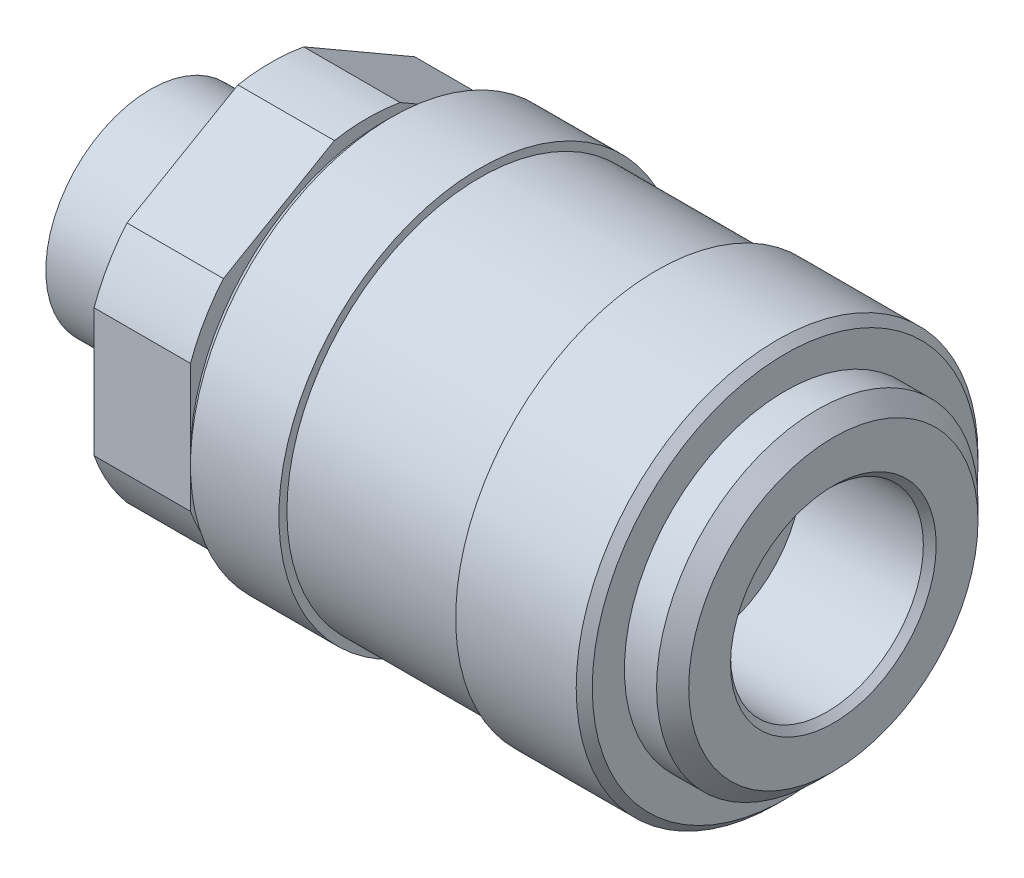
ISO-10303-21;
HEADER;
FILE_DESCRIPTION(('STEP AP214'),'2;1');
FILE_NAME('part.step','',(''),(''),'','','');
FILE_SCHEMA(('AUTOMOTIVE_DESIGN { 1 0 10303 214 1 1 1 1 }'));
ENDSEC;
DATA;
#1=APPLICATION_CONTEXT('core data for automotive mechanical design processes');
#2=APPLICATION_PROTOCOL_DEFINITION('international standard','automotive_design',2000,#1);
#3=PRODUCT_CONTEXT('',#1,'mechanical');
#4=PRODUCT('Part','Part','',(#3));
#5=PRODUCT_RELATED_PRODUCT_CATEGORY('part','',(#4));
#6=PRODUCT_DEFINITION_FORMATION('','',#4);
#7=PRODUCT_DEFINITION_CONTEXT('part definition',#1,'design');
#8=PRODUCT_DEFINITION('design','',#6,#7);
#9=PRODUCT_DEFINITION_SHAPE('','',#8);
#10=(LENGTH_UNIT() NAMED_UNIT(*) SI_UNIT(.MILLI.,.METRE.));
#11=(NAMED_UNIT(*) PLANE_ANGLE_UNIT() SI_UNIT($,.RADIAN.));
#12=(NAMED_UNIT(*) SI_UNIT($,.STERADIAN.) SOLID_ANGLE_UNIT());
#13=UNCERTAINTY_MEASURE_WITH_UNIT(LENGTH_MEASURE(1.E-05),#10,'distance_accuracy_value','');
#14=(GEOMETRIC_REPRESENTATION_CONTEXT(3) GLOBAL_UNCERTAINTY_ASSIGNED_CONTEXT((#13)) GLOBAL_UNIT_ASSIGNED_CONTEXT((#10,
#11,#12)) REPRESENTATION_CONTEXT('',''));
#15=CARTESIAN_POINT('',(0.,0.,0.));
#16=DIRECTION('',(0.,0.,1.));
#17=DIRECTION('',(1.,0.,0.));
#18=AXIS2_PLACEMENT_3D('',#15,#16,#17);
#19=CARTESIAN_POINT('',(18.0000000003133,0.,0.));
#20=DIRECTION('',(1.,0.,0.));
#21=DIRECTION('',(0.,0.,-1.));
#22=AXIS2_PLACEMENT_3D('',#19,#20,#21);
#23=CONICAL_SURFACE('',#22,3.49999999946249,0.785398162516375);
#24=CARTESIAN_POINT('',(17.,0.,0.));
#25=DIRECTION('',(1.,0.,0.));
#26=DIRECTION('',(0.,0.,-1.));
#27=AXIS2_PLACEMENT_3D('',#24,#25,#26);
#28=CIRCLE('',#27,2.5);
#29=CARTESIAN_POINT('',(17.,0.,-2.5));
#30=VERTEX_POINT('',#29);
#31=EDGE_CURVE('E165',#30,#30,#28,.F.);
#32=ORIENTED_EDGE('',*,*,#31,.T.);
#33=EDGE_LOOP('',(#32));
#34=FACE_BOUND('',#33,.T.);
#35=CARTESIAN_POINT('',(18.0000000003702,0.,0.));
#36=DIRECTION('',(1.,0.,0.));
#37=DIRECTION('',(0.,0.,-1.));
#38=AXIS2_PLACEMENT_3D('',#35,#36,#37);
#39=CIRCLE('',#38,3.49999999951933);
#40=CARTESIAN_POINT('',(18.0000000003702,0.,-3.49999999951933));
#41=VERTEX_POINT('',#40);
#42=EDGE_CURVE('E19',#41,#41,#39,.F.);
#43=ORIENTED_EDGE('',*,*,#42,.F.);
#44=EDGE_LOOP('',(#43));
#45=FACE_BOUND('',#44,.T.);
#46=ADVANCED_FACE('F16',(#34,#45),#23,.F.);
#47=CARTESIAN_POINT('',(18.,0.,0.));
#48=DIRECTION('',(1.,0.,0.));
#49=DIRECTION('',(0.,0.,-1.));
#50=AXIS2_PLACEMENT_3D('',#47,#48,#49);
#51=PLANE('',#50);
#52=ORIENTED_EDGE('',*,*,#42,.T.);
#53=EDGE_LOOP('',(#52));
#54=FACE_BOUND('',#53,.T.);
#55=CARTESIAN_POINT('',(18.,0.,0.));
#56=DIRECTION('',(1.,0.,0.));
#57=DIRECTION('',(0.,0.,-1.));
#58=AXIS2_PLACEMENT_3D('',#55,#56,#57);
#59=CIRCLE('',#58,3.65);
#60=CARTESIAN_POINT('',(18.,0.,-3.65000000000001));
#61=VERTEX_POINT('',#60);
#62=EDGE_CURVE('E168',#61,#61,#59,.T.);
#63=ORIENTED_EDGE('',*,*,#62,.T.);
#64=EDGE_LOOP('',(#63));
#65=FACE_BOUND('',#64,.T.);
#66=ADVANCED_FACE('F254',(#54,#65),#51,.T.);
#67=CARTESIAN_POINT('',(1.,0.,0.));
#68=DIRECTION('',(1.,0.,0.));
#69=DIRECTION('',(0.,0.,-1.));
#70=AXIS2_PLACEMENT_3D('',#67,#68,#69);
#71=CYLINDRICAL_SURFACE('',#70,2.5);
#72=ORIENTED_EDGE('',*,*,#31,.F.);
#73=EDGE_LOOP('',(#72));
#74=FACE_BOUND('',#73,.T.);
#75=CARTESIAN_POINT('',(-6.5,0.,0.));
#76=DIRECTION('',(1.,0.,0.));
#77=DIRECTION('',(0.,0.,-1.));
#78=AXIS2_PLACEMENT_3D('',#75,#76,#77);
#79=CIRCLE('',#78,2.5);
#80=CARTESIAN_POINT('',(-6.5,0.,-2.5));
#81=VERTEX_POINT('',#80);
#82=EDGE_CURVE('E162',#81,#81,#79,.T.);
#83=ORIENTED_EDGE('',*,*,#82,.F.);
#84=EDGE_LOOP('',(#83));
#85=FACE_BOUND('',#84,.T.);
#86=ADVANCED_FACE('F259',(#74,#85),#71,.F.);
#87=CARTESIAN_POINT('',(18.,0.,0.));
#88=DIRECTION('',(1.,0.,0.));
#89=DIRECTION('',(0.,0.,-1.));
#90=AXIS2_PLACEMENT_3D('',#87,#88,#89);
#91=CYLINDRICAL_SURFACE('',#90,3.65);
#92=CARTESIAN_POINT('',(26.9999999995321,0.,0.));
#93=DIRECTION('',(1.,0.,0.));
#94=DIRECTION('',(0.,-1.,0.));
#95=AXIS2_PLACEMENT_3D('',#92,#93,#94);
#96=CIRCLE('',#95,3.65000000039117);
#97=CARTESIAN_POINT('',(26.9999999995321,-3.65000000039117,0.));
#98=VERTEX_POINT('',#97);
#99=EDGE_CURVE('E158',#98,#98,#96,.T.);
#100=ORIENTED_EDGE('',*,*,#99,.T.);
#101=EDGE_LOOP('',(#100));
#102=FACE_BOUND('',#101,.T.);
#103=ORIENTED_EDGE('',*,*,#62,.F.);
#104=EDGE_LOOP('',(#103));
#105=FACE_BOUND('',#104,.T.);
#106=ADVANCED_FACE('F256',(#102,#105),#91,.F.);
#107=CARTESIAN_POINT('',(-6.5,-6.5,0.));
#108=DIRECTION('',(-1.,0.,0.));
#109=DIRECTION('',(0.,0.,1.));
#110=AXIS2_PLACEMENT_3D('',#107,#108,#109);
#111=PLANE('',#110);
#112=ORIENTED_EDGE('',*,*,#82,.T.);
#113=EDGE_LOOP('',(#112));
#114=FACE_BOUND('',#113,.T.);
#115=CARTESIAN_POINT('',(-6.5,0.,0.));
#116=DIRECTION('',(-1.,0.,0.));
#117=DIRECTION('',(0.,-1.,0.));
#118=AXIS2_PLACEMENT_3D('',#115,#116,#117);
#119=CIRCLE('',#118,6.5);
#120=CARTESIAN_POINT('',(-6.5,-6.5,0.));
#121=VERTEX_POINT('',#120);
#122=EDGE_CURVE('E161',#121,#121,#119,.F.);
#123=ORIENTED_EDGE('',*,*,#122,.F.);
#124=EDGE_LOOP('',(#123));
#125=FACE_BOUND('',#124,.T.);
#126=ADVANCED_FACE('F258',(#114,#125),#111,.T.);
#127=CARTESIAN_POINT('',(28.0000000004748,0.,0.));
#128=DIRECTION('',(1.,0.,0.));
#129=DIRECTION('',(0.,0.,-1.));
#130=AXIS2_PLACEMENT_3D('',#127,#128,#129);
#131=CONICAL_SURFACE('',#130,4.64999999951488,0.785398162487954);
#132=CARTESIAN_POINT('',(28.0000000004748,0.,0.));
#133=DIRECTION('',(1.,0.,0.));
#134=DIRECTION('',(0.,0.,-1.));
#135=AXIS2_PLACEMENT_3D('',#132,#133,#134);
#136=CIRCLE('',#135,4.64999999951488);
#137=CARTESIAN_POINT('',(28.0000000004748,0.,-4.64999999951488));
#138=VERTEX_POINT('',#137);
#139=EDGE_CURVE('E245',#138,#138,#136,.F.);
#140=ORIENTED_EDGE('',*,*,#139,.F.);
#141=EDGE_LOOP('',(#140));
#142=FACE_BOUND('',#141,.T.);
#143=ORIENTED_EDGE('',*,*,#99,.F.);
#144=EDGE_LOOP('',(#143));
#145=FACE_BOUND('',#144,.T.);
#146=ADVANCED_FACE('F267',(#142,#145),#131,.F.);
#147=CARTESIAN_POINT('',(0.,0.,0.));
#148=DIRECTION('',(-1.,0.,0.));
#149=DIRECTION('',(0.,-1.,0.));
#150=AXIS2_PLACEMENT_3D('',#147,#148,#149);
#151=CYLINDRICAL_SURFACE('',#150,6.5);
#152=CARTESIAN_POINT('',(0.,0.,0.));
#153=DIRECTION('',(-1.,0.,0.));
#154=DIRECTION('',(0.,-1.,0.));
#155=AXIS2_PLACEMENT_3D('',#152,#153,#154);
#156=CIRCLE('',#155,6.5);
#157=CARTESIAN_POINT('',(0.,-6.5,0.));
#158=VERTEX_POINT('',#157);
#159=EDGE_CURVE('E242',#158,#158,#156,.T.);
#160=ORIENTED_EDGE('',*,*,#159,.T.);
#161=EDGE_LOOP('',(#160));
#162=FACE_BOUND('',#161,.T.);
#163=ORIENTED_EDGE('',*,*,#122,.T.);
#164=EDGE_LOOP('',(#163));
#165=FACE_BOUND('',#164,.T.);
#166=ADVANCED_FACE('F396',(#162,#165),#151,.T.);
#167=CARTESIAN_POINT('',(28.,0.,0.));
#168=DIRECTION('',(1.,0.,0.));
#169=DIRECTION('',(0.,0.,-1.));
#170=AXIS2_PLACEMENT_3D('',#167,#168,#169);
#171=PLANE('',#170);
#172=ORIENTED_EDGE('',*,*,#139,.T.);
#173=EDGE_LOOP('',(#172));
#174=FACE_BOUND('',#173,.T.);
#175=CARTESIAN_POINT('',(28.,0.,0.));
#176=DIRECTION('',(1.,0.,0.));
#177=DIRECTION('',(0.,0.,-1.));
#178=AXIS2_PLACEMENT_3D('',#175,#176,#177);
#179=CIRCLE('',#178,6.);
#180=CARTESIAN_POINT('',(28.,0.,-6.));
#181=VERTEX_POINT('',#180);
#182=EDGE_CURVE('E239',#181,#181,#179,.T.);
#183=ORIENTED_EDGE('',*,*,#182,.T.);
#184=EDGE_LOOP('',(#183));
#185=FACE_BOUND('',#184,.T.);
#186=ADVANCED_FACE('F392',(#174,#185),#171,.T.);
#187=CARTESIAN_POINT('',(0.,0.,0.));
#188=DIRECTION('',(1.,0.,0.));
#189=DIRECTION('',(0.,0.,-1.));
#190=AXIS2_PLACEMENT_3D('',#187,#188,#189);
#191=PLANE('',#190);
#192=ORIENTED_EDGE('',*,*,#159,.F.);
#193=EDGE_LOOP('',(#192));
#194=FACE_BOUND('',#193,.T.);
#195=CARTESIAN_POINT('',(0.,0.,0.));
#196=DIRECTION('',(1.,0.,0.));
#197=DIRECTION('',(0.,0.,-1.));
#198=AXIS2_PLACEMENT_3D('',#195,#196,#197);
#199=CIRCLE('',#198,7.);
#200=CARTESIAN_POINT('',(0.,0.,-7.));
#201=VERTEX_POINT('',#200);
#202=EDGE_CURVE('E155',#201,#201,#199,.T.);
#203=ORIENTED_EDGE('',*,*,#202,.F.);
#204=EDGE_LOOP('',(#203));
#205=FACE_BOUND('',#204,.T.);
#206=ADVANCED_FACE('F388',(#194,#205),#191,.F.);
#207=CARTESIAN_POINT('',(28.,0.,0.));
#208=DIRECTION('',(1.,0.,0.));
#209=DIRECTION('',(0.,0.,-1.));
#210=AXIS2_PLACEMENT_3D('',#207,#208,#209);
#211=CYLINDRICAL_SURFACE('',#210,6.);
#212=CARTESIAN_POINT('',(35.5999999997607,0.,0.));
#213=DIRECTION('',(1.,0.,0.));
#214=DIRECTION('',(0.,-1.,0.));
#215=AXIS2_PLACEMENT_3D('',#212,#213,#214);
#216=CIRCLE('',#215,6.00000000014234);
#217=CARTESIAN_POINT('',(35.5999999997607,-6.00000000014234,0.));
#218=VERTEX_POINT('',#217);
#219=EDGE_CURVE('E151',#218,#218,#216,.T.);
#220=ORIENTED_EDGE('',*,*,#219,.T.);
#221=EDGE_LOOP('',(#220));
#222=FACE_BOUND('',#221,.T.);
#223=ORIENTED_EDGE('',*,*,#182,.F.);
#224=EDGE_LOOP('',(#223));
#225=FACE_BOUND('',#224,.T.);
#226=ADVANCED_FACE('F384',(#222,#225),#211,.F.);
#227=CARTESIAN_POINT('',(0.,0.,0.));
#228=DIRECTION('',(1.,0.,0.));
#229=DIRECTION('',(0.,0.,-1.));
#230=AXIS2_PLACEMENT_3D('',#227,#228,#229);
#231=CYLINDRICAL_SURFACE('',#230,7.);
#232=ORIENTED_EDGE('',*,*,#202,.T.);
#233=EDGE_LOOP('',(#232));
#234=FACE_BOUND('',#233,.T.);
#235=CARTESIAN_POINT('',(1.,0.,0.));
#236=DIRECTION('',(1.,0.,0.));
#237=DIRECTION('',(0.,0.,-1.));
#238=AXIS2_PLACEMENT_3D('',#235,#236,#237);
#239=CIRCLE('',#238,7.);
#240=CARTESIAN_POINT('',(1.,0.,-7.));
#241=VERTEX_POINT('',#240);
#242=EDGE_CURVE('E154',#241,#241,#239,.F.);
#243=ORIENTED_EDGE('',*,*,#242,.T.);
#244=EDGE_LOOP('',(#243));
#245=FACE_BOUND('',#244,.T.);
#246=ADVANCED_FACE('F380',(#234,#245),#231,.T.);
#247=CARTESIAN_POINT('',(36.0000000000582,0.,0.));
#248=DIRECTION('',(1.,0.,0.));
#249=DIRECTION('',(0.,0.,-1.));
#250=AXIS2_PLACEMENT_3D('',#247,#248,#249);
#251=CONICAL_SURFACE('',#250,6.39999999970087,0.785398162473743);
#252=CARTESIAN_POINT('',(36.0000000001151,0.,0.));
#253=DIRECTION('',(1.,0.,0.));
#254=DIRECTION('',(0.,0.,-1.));
#255=AXIS2_PLACEMENT_3D('',#252,#253,#254);
#256=CIRCLE('',#255,6.39999999975771);
#257=CARTESIAN_POINT('',(36.0000000001151,0.,-6.39999999975771));
#258=VERTEX_POINT('',#257);
#259=EDGE_CURVE('E135',#258,#258,#256,.F.);
#260=ORIENTED_EDGE('',*,*,#259,.F.);
#261=EDGE_LOOP('',(#260));
#262=FACE_BOUND('',#261,.T.);
#263=ORIENTED_EDGE('',*,*,#219,.F.);
#264=EDGE_LOOP('',(#263));
#265=FACE_BOUND('',#264,.T.);
#266=ADVANCED_FACE('F376',(#262,#265),#251,.F.);
#267=CARTESIAN_POINT('',(1.,0.,0.));
#268=DIRECTION('',(1.,0.,0.));
#269=DIRECTION('',(0.,0.,-1.));
#270=AXIS2_PLACEMENT_3D('',#267,#268,#269);
#271=PLANE('',#270);
#272=ORIENTED_EDGE('',*,*,#242,.F.);
#273=EDGE_LOOP('',(#272));
#274=FACE_BOUND('',#273,.T.);
#275=DIRECTION('',(0.,1.,0.));
#276=VECTOR('',#275,1.);
#277=CARTESIAN_POINT('',(1.,3.98622628559895,-11.));
#278=LINE('',#277,#276);
#279=CARTESIAN_POINT('',(1.,-3.98622628559891,-11.));
#280=VERTEX_POINT('',#279);
#281=CARTESIAN_POINT('',(1.,3.98622628559894,-11.));
#282=VERTEX_POINT('',#281);
#283=EDGE_CURVE('E101',#280,#282,#278,.T.);
#284=ORIENTED_EDGE('',*,*,#283,.F.);
#285=CARTESIAN_POINT('',(1.,0.,0.));
#286=DIRECTION('',(1.,0.,0.));
#287=DIRECTION('',(0.,0.,-1.));
#288=AXIS2_PLACEMENT_3D('',#285,#286,#287);
#289=CIRCLE('',#288,11.7);
#290=CARTESIAN_POINT('',(1.,-7.53316629882931,-8.95217322856204));
#291=VERTEX_POINT('',#290);
#292=EDGE_CURVE('E223',#291,#280,#289,.T.);
#293=ORIENTED_EDGE('',*,*,#292,.F.);
#294=DIRECTION('',(0.,0.500000000000001,-0.866025403784438));
#295=VECTOR('',#294,1.);
#296=CARTESIAN_POINT('',(1.,-7.53316629882931,-8.95217322856202));
#297=LINE('',#296,#295);
#298=CARTESIAN_POINT('',(1.,-11.5193925844283,-2.04782677143809));
#299=VERTEX_POINT('',#298);
#300=EDGE_CURVE('E136',#299,#291,#297,.T.);
#301=ORIENTED_EDGE('',*,*,#300,.F.);
#302=CARTESIAN_POINT('',(1.,2.273737E-13,0.));
#303=DIRECTION('',(1.,0.,0.));
#304=DIRECTION('',(0.,0.,-1.));
#305=AXIS2_PLACEMENT_3D('',#302,#303,#304);
#306=CIRCLE('',#305,11.7000000000002);
#307=CARTESIAN_POINT('',(1.,-11.5193925844283,2.04782677143797));
#308=VERTEX_POINT('',#307);
#309=EDGE_CURVE('E226',#308,#299,#306,.T.);
#310=ORIENTED_EDGE('',*,*,#309,.F.);
#311=DIRECTION('',(0.,-0.500000000000002,-0.866025403784438));
#312=VECTOR('',#311,1.);
#313=CARTESIAN_POINT('',(1.,-11.5193925844283,2.04782677143796));
#314=LINE('',#313,#312);
#315=CARTESIAN_POINT('',(1.,-7.53316629882924,8.95217322856199));
#316=VERTEX_POINT('',#315);
#317=EDGE_CURVE('E139',#316,#308,#314,.T.);
#318=ORIENTED_EDGE('',*,*,#317,.F.);
#319=CARTESIAN_POINT('',(1.,0.,0.));
#320=DIRECTION('',(1.,0.,0.));
#321=DIRECTION('',(0.,0.,-1.));
#322=AXIS2_PLACEMENT_3D('',#319,#320,#321);
#323=CIRCLE('',#322,11.7);
#324=CARTESIAN_POINT('',(1.,-3.98622628559894,11.));
#325=VERTEX_POINT('',#324);
#326=EDGE_CURVE('E228',#325,#316,#323,.T.);
#327=ORIENTED_EDGE('',*,*,#326,.F.);
#328=DIRECTION('',(0.,1.,0.));
#329=VECTOR('',#328,1.);
#330=CARTESIAN_POINT('',(1.,-3.98622628559895,11.));
#331=LINE('',#330,#329);
#332=CARTESIAN_POINT('',(1.,3.986226285599,11.));
#333=VERTEX_POINT('',#332);
#334=EDGE_CURVE('E143',#333,#325,#331,.F.);
#335=ORIENTED_EDGE('',*,*,#334,.F.);
#336=CARTESIAN_POINT('',(1.,0.,0.));
#337=DIRECTION('',(1.,0.,0.));
#338=DIRECTION('',(0.,0.,-1.));
#339=AXIS2_PLACEMENT_3D('',#336,#337,#338);
#340=CIRCLE('',#339,11.7);
#341=CARTESIAN_POINT('',(1.,7.53316629882938,8.95217322856194));
#342=VERTEX_POINT('',#341);
#343=EDGE_CURVE('E230',#342,#333,#340,.T.);
#344=ORIENTED_EDGE('',*,*,#343,.F.);
#345=DIRECTION('',(0.,-0.499999999999999,0.866025403784439));
#346=VECTOR('',#345,1.);
#347=CARTESIAN_POINT('',(1.,7.53316629882937,8.95217322856195));
#348=LINE('',#347,#346);
#349=CARTESIAN_POINT('',(1.,11.5193925844283,2.04782677143795));
#350=VERTEX_POINT('',#349);
#351=EDGE_CURVE('E147',#350,#342,#348,.T.);
#352=ORIENTED_EDGE('',*,*,#351,.F.);
#353=CARTESIAN_POINT('',(1.,1.136868E-13,0.));
#354=DIRECTION('',(1.,0.,0.));
#355=DIRECTION('',(0.,0.,-1.));
#356=AXIS2_PLACEMENT_3D('',#353,#354,#355);
#357=CIRCLE('',#356,11.6999999999999);
#358=CARTESIAN_POINT('',(1.,11.5193925844284,-2.04782677143802));
#359=VERTEX_POINT('',#358);
#360=EDGE_CURVE('E120',#359,#350,#357,.T.);
#361=ORIENTED_EDGE('',*,*,#360,.F.);
#362=DIRECTION('',(0.,0.499999999999998,0.86602540378444));
#363=VECTOR('',#362,1.);
#364=CARTESIAN_POINT('',(1.,11.5193925844283,-2.04782677143805));
#365=LINE('',#364,#363);
#366=CARTESIAN_POINT('',(1.,7.53316629882938,-8.95217322856201));
#367=VERTEX_POINT('',#366);
#368=EDGE_CURVE('E117',#367,#359,#365,.T.);
#369=ORIENTED_EDGE('',*,*,#368,.F.);
#370=CARTESIAN_POINT('',(1.,0.,0.));
#371=DIRECTION('',(1.,0.,0.));
#372=DIRECTION('',(0.,0.,-1.));
#373=AXIS2_PLACEMENT_3D('',#370,#371,#372);
#374=CIRCLE('',#373,11.7000000000001);
#375=EDGE_CURVE('E106',#282,#367,#374,.T.);
#376=ORIENTED_EDGE('',*,*,#375,.F.);
#377=EDGE_LOOP('',(#284,#293,#301,#310,#318,#327,#335,#344,#352,#361,#369,#376));
#378=FACE_BOUND('',#377,.T.);
#379=ADVANCED_FACE('F118',(#274,#378),#271,.F.);
#380=CARTESIAN_POINT('',(36.,10.,0.));
#381=DIRECTION('',(1.,0.,0.));
#382=DIRECTION('',(0.,0.,-1.));
#383=AXIS2_PLACEMENT_3D('',#380,#381,#382);
#384=PLANE('',#383);
#385=ORIENTED_EDGE('',*,*,#259,.T.);
#386=EDGE_LOOP('',(#385));
#387=FACE_BOUND('',#386,.T.);
#388=CARTESIAN_POINT('',(36.0000000004488,0.,0.));
#389=DIRECTION('',(-1.,0.,0.));
#390=DIRECTION('',(0.,0.,1.));
#391=AXIS2_PLACEMENT_3D('',#388,#389,#390);
#392=CIRCLE('',#391,9.00000000044872);
#393=CARTESIAN_POINT('',(36.0000000004488,0.,9.00000000044872));
#394=VERTEX_POINT('',#393);
#395=EDGE_CURVE('E219',#394,#394,#392,.T.);
#396=ORIENTED_EDGE('',*,*,#395,.F.);
#397=EDGE_LOOP('',(#396));
#398=FACE_BOUND('',#397,.T.);
#399=ADVANCED_FACE('F370',(#387,#398),#384,.T.);
#400=CARTESIAN_POINT('',(1.,3.98622628559895,-11.));
#401=DIRECTION('',(0.,0.,-1.));
#402=DIRECTION('',(-1.,0.,0.));
#403=AXIS2_PLACEMENT_3D('',#400,#401,#402);
#404=PLANE('',#403);
#405=ORIENTED_EDGE('',*,*,#283,.T.);
#406=DIRECTION('',(1.,0.,0.));
#407=VECTOR('',#406,1.);
#408=CARTESIAN_POINT('',(1.,3.98622628559895,-11.));
#409=LINE('',#408,#407);
#410=CARTESIAN_POINT('',(7.,3.98622628559894,-11.));
#411=VERTEX_POINT('',#410);
#412=EDGE_CURVE('E113',#411,#282,#409,.F.);
#413=ORIENTED_EDGE('',*,*,#412,.F.);
#414=DIRECTION('',(0.,1.,0.));
#415=VECTOR('',#414,1.);
#416=CARTESIAN_POINT('',(7.,3.98622628559895,-11.));
#417=LINE('',#416,#415);
#418=CARTESIAN_POINT('',(7.,-3.98622628559891,-11.));
#419=VERTEX_POINT('',#418);
#420=EDGE_CURVE('E218',#419,#411,#417,.T.);
#421=ORIENTED_EDGE('',*,*,#420,.F.);
#422=DIRECTION('',(1.,0.,0.));
#423=VECTOR('',#422,1.);
#424=CARTESIAN_POINT('',(1.,-3.9862262855989,-11.0000000000001));
#425=LINE('',#424,#423);
#426=EDGE_CURVE('E222',#280,#419,#425,.T.);
#427=ORIENTED_EDGE('',*,*,#426,.F.);
#428=EDGE_LOOP('',(#405,#413,#421,#427));
#429=FACE_BOUND('',#428,.T.);
#430=ADVANCED_FACE('F367',(#429),#404,.T.);
#431=CARTESIAN_POINT('',(1.,0.,0.));
#432=DIRECTION('',(1.,0.,0.));
#433=DIRECTION('',(0.,0.,-1.));
#434=AXIS2_PLACEMENT_3D('',#431,#432,#433);
#435=CYLINDRICAL_SURFACE('',#434,11.7000000000001);
#436=ORIENTED_EDGE('',*,*,#375,.T.);
#437=DIRECTION('',(1.,0.,0.));
#438=VECTOR('',#437,1.);
#439=CARTESIAN_POINT('',(1.,7.53316629882938,-8.95217322856202));
#440=LINE('',#439,#438);
#441=CARTESIAN_POINT('',(7.,7.53316629882938,-8.95217322856202));
#442=VERTEX_POINT('',#441);
#443=EDGE_CURVE('E111',#442,#367,#440,.F.);
#444=ORIENTED_EDGE('',*,*,#443,.F.);
#445=CARTESIAN_POINT('',(7.,0.,0.));
#446=DIRECTION('',(1.,0.,0.));
#447=DIRECTION('',(0.,0.,-1.));
#448=AXIS2_PLACEMENT_3D('',#445,#446,#447);
#449=CIRCLE('',#448,11.7000000000001);
#450=EDGE_CURVE('E216',#411,#442,#449,.T.);
#451=ORIENTED_EDGE('',*,*,#450,.F.);
#452=ORIENTED_EDGE('',*,*,#412,.T.);
#453=EDGE_LOOP('',(#436,#444,#451,#452));
#454=FACE_BOUND('',#453,.T.);
#455=ADVANCED_FACE('F108',(#454),#435,.T.);
#456=CARTESIAN_POINT('',(1.,11.5193925844283,-2.04782677143805));
#457=DIRECTION('',(0.,0.86602540378444,-0.499999999999998));
#458=DIRECTION('',(0.,0.499999999999998,0.86602540378444));
#459=AXIS2_PLACEMENT_3D('',#456,#457,#458);
#460=PLANE('',#459);
#461=ORIENTED_EDGE('',*,*,#368,.T.);
#462=DIRECTION('',(1.,0.,0.));
#463=VECTOR('',#462,1.);
#464=CARTESIAN_POINT('',(1.,11.5193925844283,-2.04782677143805));
#465=LINE('',#464,#463);
#466=CARTESIAN_POINT('',(7.,11.5193925844284,-2.04782677143802));
#467=VERTEX_POINT('',#466);
#468=EDGE_CURVE('E123',#467,#359,#465,.F.);
#469=ORIENTED_EDGE('',*,*,#468,.F.);
#470=DIRECTION('',(0.,0.499999999999998,0.86602540378444));
#471=VECTOR('',#470,1.);
#472=CARTESIAN_POINT('',(7.,7.53316629882937,-8.95217322856202));
#473=LINE('',#472,#471);
#474=EDGE_CURVE('E127',#442,#467,#473,.T.);
#475=ORIENTED_EDGE('',*,*,#474,.F.);
#476=ORIENTED_EDGE('',*,*,#443,.T.);
#477=EDGE_LOOP('',(#461,#469,#475,#476));
#478=FACE_BOUND('',#477,.T.);
#479=ADVANCED_FACE('F125',(#478),#460,.T.);
#480=CARTESIAN_POINT('',(1.,1.136868E-13,0.));
#481=DIRECTION('',(1.,0.,0.));
#482=DIRECTION('',(0.,0.,-1.));
#483=AXIS2_PLACEMENT_3D('',#480,#481,#482);
#484=CYLINDRICAL_SURFACE('',#483,11.6999999999999);
#485=ORIENTED_EDGE('',*,*,#360,.T.);
#486=DIRECTION('',(1.,0.,0.));
#487=VECTOR('',#486,1.);
#488=CARTESIAN_POINT('',(1.,11.5193925844283,2.04782677143795));
#489=LINE('',#488,#487);
#490=CARTESIAN_POINT('',(7.,11.5193925844283,2.04782677143791));
#491=VERTEX_POINT('',#490);
#492=EDGE_CURVE('E149',#491,#350,#489,.F.);
#493=ORIENTED_EDGE('',*,*,#492,.F.);
#494=CARTESIAN_POINT('',(7.,1.136868E-13,0.));
#495=DIRECTION('',(1.,0.,0.));
#496=DIRECTION('',(0.,0.,-1.));
#497=AXIS2_PLACEMENT_3D('',#494,#495,#496);
#498=CIRCLE('',#497,11.6999999999999);
#499=EDGE_CURVE('E213',#467,#491,#498,.T.);
#500=ORIENTED_EDGE('',*,*,#499,.F.);
#501=ORIENTED_EDGE('',*,*,#468,.T.);
#502=EDGE_LOOP('',(#485,#493,#500,#501));
#503=FACE_BOUND('',#502,.T.);
#504=ADVANCED_FACE('F358',(#503),#484,.T.);
#505=CARTESIAN_POINT('',(1.,7.53316629882937,8.95217322856195));
#506=DIRECTION('',(0.,0.866025403784439,0.499999999999999));
#507=DIRECTION('',(0.,-0.499999999999999,0.866025403784439));
#508=AXIS2_PLACEMENT_3D('',#505,#506,#507);
#509=PLANE('',#508);
#510=ORIENTED_EDGE('',*,*,#351,.T.);
#511=DIRECTION('',(1.,0.,0.));
#512=VECTOR('',#511,1.);
#513=CARTESIAN_POINT('',(1.,7.53316629882937,8.95217322856194));
#514=LINE('',#513,#512);
#515=CARTESIAN_POINT('',(7.,7.53316629882937,8.95217322856194));
#516=VERTEX_POINT('',#515);
#517=EDGE_CURVE('E148',#516,#342,#514,.F.);
#518=ORIENTED_EDGE('',*,*,#517,.F.);
#519=DIRECTION('',(0.,-0.499999999999997,0.866025403784441));
#520=VECTOR('',#519,1.);
#521=CARTESIAN_POINT('',(7.,11.5193925844283,2.04782677143794));
#522=LINE('',#521,#520);
#523=EDGE_CURVE('E212',#491,#516,#522,.T.);
#524=ORIENTED_EDGE('',*,*,#523,.F.);
#525=ORIENTED_EDGE('',*,*,#492,.T.);
#526=EDGE_LOOP('',(#510,#518,#524,#525));
#527=FACE_BOUND('',#526,.T.);
#528=ADVANCED_FACE('F354',(#527),#509,.T.);
#529=CARTESIAN_POINT('',(1.,0.,0.));
#530=DIRECTION('',(1.,0.,0.));
#531=DIRECTION('',(0.,0.,-1.));
#532=AXIS2_PLACEMENT_3D('',#529,#530,#531);
#533=CYLINDRICAL_SURFACE('',#532,11.7);
#534=ORIENTED_EDGE('',*,*,#343,.T.);
#535=DIRECTION('',(1.,0.,0.));
#536=VECTOR('',#535,1.);
#537=CARTESIAN_POINT('',(1.,3.986226285599,11.));
#538=LINE('',#537,#536);
#539=CARTESIAN_POINT('',(7.,3.986226285599,11.));
#540=VERTEX_POINT('',#539);
#541=EDGE_CURVE('E146',#540,#333,#538,.F.);
#542=ORIENTED_EDGE('',*,*,#541,.F.);
#543=CARTESIAN_POINT('',(7.,0.,0.));
#544=DIRECTION('',(1.,0.,0.));
#545=DIRECTION('',(0.,0.,-1.));
#546=AXIS2_PLACEMENT_3D('',#543,#544,#545);
#547=CIRCLE('',#546,11.7);
#548=EDGE_CURVE('E209',#516,#540,#547,.T.);
#549=ORIENTED_EDGE('',*,*,#548,.F.);
#550=ORIENTED_EDGE('',*,*,#517,.T.);
#551=EDGE_LOOP('',(#534,#542,#549,#550));
#552=FACE_BOUND('',#551,.T.);
#553=ADVANCED_FACE('F350',(#552),#533,.T.);
#554=CARTESIAN_POINT('',(1.,-3.98622628559895,11.));
#555=DIRECTION('',(0.,0.,1.));
#556=DIRECTION('',(1.,0.,0.));
#557=AXIS2_PLACEMENT_3D('',#554,#555,#556);
#558=PLANE('',#557);
#559=ORIENTED_EDGE('',*,*,#334,.T.);
#560=DIRECTION('',(1.,0.,0.));
#561=VECTOR('',#560,1.);
#562=CARTESIAN_POINT('',(1.,-3.98622628559894,11.));
#563=LINE('',#562,#561);
#564=CARTESIAN_POINT('',(7.,-3.98622628559895,11.));
#565=VERTEX_POINT('',#564);
#566=EDGE_CURVE('E145',#565,#325,#563,.F.);
#567=ORIENTED_EDGE('',*,*,#566,.F.);
#568=DIRECTION('',(0.,1.,0.));
#569=VECTOR('',#568,1.);
#570=CARTESIAN_POINT('',(7.,3.98622628559895,10.9999999999999));
#571=LINE('',#570,#569);
#572=EDGE_CURVE('E208',#540,#565,#571,.F.);
#573=ORIENTED_EDGE('',*,*,#572,.F.);
#574=ORIENTED_EDGE('',*,*,#541,.T.);
#575=EDGE_LOOP('',(#559,#567,#573,#574));
#576=FACE_BOUND('',#575,.T.);
#577=ADVANCED_FACE('F346',(#576),#558,.T.);
#578=CARTESIAN_POINT('',(1.,0.,0.));
#579=DIRECTION('',(1.,0.,0.));
#580=DIRECTION('',(0.,0.,-1.));
#581=AXIS2_PLACEMENT_3D('',#578,#579,#580);
#582=CYLINDRICAL_SURFACE('',#581,11.7);
#583=ORIENTED_EDGE('',*,*,#326,.T.);
#584=DIRECTION('',(1.,0.,0.));
#585=VECTOR('',#584,1.);
#586=CARTESIAN_POINT('',(1.,-7.53316629882925,8.95217322856199));
#587=LINE('',#586,#585);
#588=CARTESIAN_POINT('',(7.,-7.53316629882926,8.95217322856199));
#589=VERTEX_POINT('',#588);
#590=EDGE_CURVE('E142',#589,#316,#587,.F.);
#591=ORIENTED_EDGE('',*,*,#590,.F.);
#592=CARTESIAN_POINT('',(7.,0.,0.));
#593=DIRECTION('',(1.,0.,0.));
#594=DIRECTION('',(0.,0.,-1.));
#595=AXIS2_PLACEMENT_3D('',#592,#593,#594);
#596=CIRCLE('',#595,11.7);
#597=EDGE_CURVE('E205',#565,#589,#596,.T.);
#598=ORIENTED_EDGE('',*,*,#597,.F.);
#599=ORIENTED_EDGE('',*,*,#566,.T.);
#600=EDGE_LOOP('',(#583,#591,#598,#599));
#601=FACE_BOUND('',#600,.T.);
#602=ADVANCED_FACE('F342',(#601),#582,.T.);
#603=CARTESIAN_POINT('',(1.,-11.5193925844283,2.04782677143796));
#604=DIRECTION('',(0.,-0.866025403784438,0.500000000000002));
#605=DIRECTION('',(0.,-0.500000000000002,-0.866025403784438));
#606=AXIS2_PLACEMENT_3D('',#603,#604,#605);
#607=PLANE('',#606);
#608=ORIENTED_EDGE('',*,*,#317,.T.);
#609=DIRECTION('',(1.,0.,0.));
#610=VECTOR('',#609,1.);
#611=CARTESIAN_POINT('',(1.,-11.5193925844283,2.04782677143796));
#612=LINE('',#611,#610);
#613=CARTESIAN_POINT('',(7.,-11.5193925844283,2.04782677143797));
#614=VERTEX_POINT('',#613);
#615=EDGE_CURVE('E141',#614,#308,#612,.F.);
#616=ORIENTED_EDGE('',*,*,#615,.F.);
#617=DIRECTION('',(0.,-0.500000000000001,-0.866025403784438));
#618=VECTOR('',#617,1.);
#619=CARTESIAN_POINT('',(7.,-7.53316629882926,8.95217322856199));
#620=LINE('',#619,#618);
#621=EDGE_CURVE('E204',#589,#614,#620,.T.);
#622=ORIENTED_EDGE('',*,*,#621,.F.);
#623=ORIENTED_EDGE('',*,*,#590,.T.);
#624=EDGE_LOOP('',(#608,#616,#622,#623));
#625=FACE_BOUND('',#624,.T.);
#626=ADVANCED_FACE('F338',(#625),#607,.T.);
#627=CARTESIAN_POINT('',(1.,2.273737E-13,0.));
#628=DIRECTION('',(1.,0.,0.));
#629=DIRECTION('',(0.,0.,-1.));
#630=AXIS2_PLACEMENT_3D('',#627,#628,#629);
#631=CYLINDRICAL_SURFACE('',#630,11.7000000000002);
#632=ORIENTED_EDGE('',*,*,#309,.T.);
#633=DIRECTION('',(1.,0.,0.));
#634=VECTOR('',#633,1.);
#635=CARTESIAN_POINT('',(1.,-11.5193925844283,-2.04782677143807));
#636=LINE('',#635,#634);
#637=CARTESIAN_POINT('',(7.,-11.5193925844283,-2.04782677143807));
#638=VERTEX_POINT('',#637);
#639=EDGE_CURVE('E138',#638,#299,#636,.F.);
#640=ORIENTED_EDGE('',*,*,#639,.F.);
#641=CARTESIAN_POINT('',(7.,2.273737E-13,0.));
#642=DIRECTION('',(1.,0.,0.));
#643=DIRECTION('',(0.,0.,-1.));
#644=AXIS2_PLACEMENT_3D('',#641,#642,#643);
#645=CIRCLE('',#644,11.7000000000002);
#646=EDGE_CURVE('E201',#614,#638,#645,.T.);
#647=ORIENTED_EDGE('',*,*,#646,.F.);
#648=ORIENTED_EDGE('',*,*,#615,.T.);
#649=EDGE_LOOP('',(#632,#640,#647,#648));
#650=FACE_BOUND('',#649,.T.);
#651=ADVANCED_FACE('F335',(#650),#631,.T.);
#652=CARTESIAN_POINT('',(1.,-7.53316629882931,-8.95217322856202));
#653=DIRECTION('',(0.,-0.866025403784438,-0.500000000000001));
#654=DIRECTION('',(0.,0.500000000000001,-0.866025403784438));
#655=AXIS2_PLACEMENT_3D('',#652,#653,#654);
#656=PLANE('',#655);
#657=ORIENTED_EDGE('',*,*,#300,.T.);
#658=DIRECTION('',(1.,0.,0.));
#659=VECTOR('',#658,1.);
#660=CARTESIAN_POINT('',(1.,-7.53316629882932,-8.95217322856203));
#661=LINE('',#660,#659);
#662=CARTESIAN_POINT('',(7.,-7.53316629882931,-8.95217322856204));
#663=VERTEX_POINT('',#662);
#664=EDGE_CURVE('E34',#663,#291,#661,.F.);
#665=ORIENTED_EDGE('',*,*,#664,.F.);
#666=DIRECTION('',(0.,0.499999999999999,-0.866025403784439));
#667=VECTOR('',#666,1.);
#668=CARTESIAN_POINT('',(7.,-11.5193925844283,-2.04782677143807));
#669=LINE('',#668,#667);
#670=EDGE_CURVE('E200',#638,#663,#669,.T.);
#671=ORIENTED_EDGE('',*,*,#670,.F.);
#672=ORIENTED_EDGE('',*,*,#639,.T.);
#673=EDGE_LOOP('',(#657,#665,#671,#672));
#674=FACE_BOUND('',#673,.T.);
#675=ADVANCED_FACE('F331',(#674),#656,.T.);
#676=CARTESIAN_POINT('',(1.,0.,0.));
#677=DIRECTION('',(1.,0.,0.));
#678=DIRECTION('',(0.,0.,-1.));
#679=AXIS2_PLACEMENT_3D('',#676,#677,#678);
#680=CYLINDRICAL_SURFACE('',#679,11.7);
#681=ORIENTED_EDGE('',*,*,#292,.T.);
#682=ORIENTED_EDGE('',*,*,#426,.T.);
#683=CARTESIAN_POINT('',(7.,0.,0.));
#684=DIRECTION('',(1.,0.,0.));
#685=DIRECTION('',(0.,0.,-1.));
#686=AXIS2_PLACEMENT_3D('',#683,#684,#685);
#687=CIRCLE('',#686,11.7);
#688=EDGE_CURVE('E197',#663,#419,#687,.T.);
#689=ORIENTED_EDGE('',*,*,#688,.F.);
#690=ORIENTED_EDGE('',*,*,#664,.T.);
#691=EDGE_LOOP('',(#681,#682,#689,#690));
#692=FACE_BOUND('',#691,.T.);
#693=ADVANCED_FACE('F327',(#692),#680,.T.);
#694=CARTESIAN_POINT('',(34.9999999995513,0.,0.));
#695=DIRECTION('',(-1.,0.,0.));
#696=DIRECTION('',(0.,0.,1.));
#697=AXIS2_PLACEMENT_3D('',#694,#695,#696);
#698=CONICAL_SURFACE('',#697,9.99999999955128,0.7853981625);
#699=CARTESIAN_POINT('',(35.,0.,0.));
#700=DIRECTION('',(1.,0.,0.));
#701=DIRECTION('',(0.,0.,-1.));
#702=AXIS2_PLACEMENT_3D('',#699,#700,#701);
#703=CIRCLE('',#702,10.);
#704=CARTESIAN_POINT('',(35.,0.,-10.));
#705=VERTEX_POINT('',#704);
#706=EDGE_CURVE('E196',#705,#705,#703,.F.);
#707=ORIENTED_EDGE('',*,*,#706,.F.);
#708=EDGE_LOOP('',(#707));
#709=FACE_BOUND('',#708,.T.);
#710=ORIENTED_EDGE('',*,*,#395,.T.);
#711=EDGE_LOOP('',(#710));
#712=FACE_BOUND('',#711,.T.);
#713=ADVANCED_FACE('F323',(#709,#712),#698,.T.);
#714=CARTESIAN_POINT('',(7.,3.98622628559895,-11.));
#715=DIRECTION('',(1.,0.,0.));
#716=DIRECTION('',(0.,0.,-1.));
#717=AXIS2_PLACEMENT_3D('',#714,#715,#716);
#718=PLANE('',#717);
#719=CARTESIAN_POINT('',(7.,0.,0.));
#720=DIRECTION('',(1.,0.,0.));
#721=DIRECTION('',(0.,0.,-1.));
#722=AXIS2_PLACEMENT_3D('',#719,#720,#721);
#723=CIRCLE('',#722,10.);
#724=CARTESIAN_POINT('',(7.,0.,-10.));
#725=VERTEX_POINT('',#724);
#726=EDGE_CURVE('E193',#725,#725,#723,.T.);
#727=ORIENTED_EDGE('',*,*,#726,.F.);
#728=EDGE_LOOP('',(#727));
#729=FACE_BOUND('',#728,.T.);
#730=ORIENTED_EDGE('',*,*,#670,.T.);
#731=ORIENTED_EDGE('',*,*,#688,.T.);
#732=ORIENTED_EDGE('',*,*,#420,.T.);
#733=ORIENTED_EDGE('',*,*,#450,.T.);
#734=ORIENTED_EDGE('',*,*,#474,.T.);
#735=ORIENTED_EDGE('',*,*,#499,.T.);
#736=ORIENTED_EDGE('',*,*,#523,.T.);
#737=ORIENTED_EDGE('',*,*,#548,.T.);
#738=ORIENTED_EDGE('',*,*,#572,.T.);
#739=ORIENTED_EDGE('',*,*,#597,.T.);
#740=ORIENTED_EDGE('',*,*,#621,.T.);
#741=ORIENTED_EDGE('',*,*,#646,.T.);
#742=EDGE_LOOP('',(#730,#731,#732,#733,#734,#735,#736,#737,#738,#739,#740,#741));
#743=FACE_BOUND('',#742,.T.);
#744=ADVANCED_FACE('F319',(#729,#743),#718,.T.);
#745=CARTESIAN_POINT('',(1.,0.,0.));
#746=DIRECTION('',(1.,0.,0.));
#747=DIRECTION('',(0.,0.,-1.));
#748=AXIS2_PLACEMENT_3D('',#745,#746,#747);
#749=CYLINDRICAL_SURFACE('',#748,10.);
#750=ORIENTED_EDGE('',*,*,#706,.T.);
#751=EDGE_LOOP('',(#750));
#752=FACE_BOUND('',#751,.T.);
#753=CARTESIAN_POINT('',(33.,0.,0.));
#754=DIRECTION('',(1.,0.,0.));
#755=DIRECTION('',(0.,0.,-1.));
#756=AXIS2_PLACEMENT_3D('',#753,#754,#755);
#757=CIRCLE('',#756,10.);
#758=CARTESIAN_POINT('',(33.,0.,-10.));
#759=VERTEX_POINT('',#758);
#760=EDGE_CURVE('E190',#759,#759,#757,.F.);
#761=ORIENTED_EDGE('',*,*,#760,.F.);
#762=EDGE_LOOP('',(#761));
#763=FACE_BOUND('',#762,.T.);
#764=ADVANCED_FACE('F315',(#752,#763),#749,.T.);
#765=CARTESIAN_POINT('',(1.,0.,0.));
#766=DIRECTION('',(1.,0.,0.));
#767=DIRECTION('',(0.,0.,-1.));
#768=AXIS2_PLACEMENT_3D('',#765,#766,#767);
#769=CYLINDRICAL_SURFACE('',#768,10.);
#770=CARTESIAN_POINT('',(8.,0.,0.));
#771=DIRECTION('',(1.,0.,0.));
#772=DIRECTION('',(0.,0.,-1.));
#773=AXIS2_PLACEMENT_3D('',#770,#771,#772);
#774=CIRCLE('',#773,10.);
#775=CARTESIAN_POINT('',(8.,0.,-10.));
#776=VERTEX_POINT('',#775);
#777=EDGE_CURVE('E187',#776,#776,#774,.F.);
#778=ORIENTED_EDGE('',*,*,#777,.T.);
#779=EDGE_LOOP('',(#778));
#780=FACE_BOUND('',#779,.T.);
#781=ORIENTED_EDGE('',*,*,#726,.T.);
#782=EDGE_LOOP('',(#781));
#783=FACE_BOUND('',#782,.T.);
#784=ADVANCED_FACE('F311',(#780,#783),#769,.T.);
#785=CARTESIAN_POINT('',(33.,12.5,0.));
#786=DIRECTION('',(1.,0.,0.));
#787=DIRECTION('',(0.,0.,-1.));
#788=AXIS2_PLACEMENT_3D('',#785,#786,#787);
#789=PLANE('',#788);
#790=ORIENTED_EDGE('',*,*,#760,.T.);
#791=EDGE_LOOP('',(#790));
#792=FACE_BOUND('',#791,.T.);
#793=CARTESIAN_POINT('',(33.0000000002244,0.,0.));
#794=DIRECTION('',(-1.,0.,0.));
#795=DIRECTION('',(0.,0.,1.));
#796=AXIS2_PLACEMENT_3D('',#793,#794,#795);
#797=CIRCLE('',#796,12.0000000002244);
#798=CARTESIAN_POINT('',(33.0000000002244,0.,12.0000000002244));
#799=VERTEX_POINT('',#798);
#800=EDGE_CURVE('E184',#799,#799,#797,.T.);
#801=ORIENTED_EDGE('',*,*,#800,.F.);
#802=EDGE_LOOP('',(#801));
#803=FACE_BOUND('',#802,.T.);
#804=ADVANCED_FACE('F307',(#792,#803),#789,.T.);
#805=CARTESIAN_POINT('',(8.,0.,0.));
#806=DIRECTION('',(1.,0.,0.));
#807=DIRECTION('',(0.,0.,-1.));
#808=AXIS2_PLACEMENT_3D('',#805,#806,#807);
#809=PLANE('',#808);
#810=ORIENTED_EDGE('',*,*,#777,.F.);
#811=EDGE_LOOP('',(#810));
#812=FACE_BOUND('',#811,.T.);
#813=CARTESIAN_POINT('',(7.99999999977564,0.,0.));
#814=DIRECTION('',(1.,0.,0.));
#815=DIRECTION('',(0.,0.,-1.));
#816=AXIS2_PLACEMENT_3D('',#813,#814,#815);
#817=CIRCLE('',#816,12.0000000002244);
#818=CARTESIAN_POINT('',(7.99999999977564,0.,-12.0000000002244));
#819=VERTEX_POINT('',#818);
#820=EDGE_CURVE('E180',#819,#819,#817,.T.);
#821=ORIENTED_EDGE('',*,*,#820,.F.);
#822=EDGE_LOOP('',(#821));
#823=FACE_BOUND('',#822,.T.);
#824=ADVANCED_FACE('F303',(#812,#823),#809,.F.);
#825=CARTESIAN_POINT('',(32.4999999997757,0.,0.));
#826=DIRECTION('',(-1.,0.,0.));
#827=DIRECTION('',(0.,0.,1.));
#828=AXIS2_PLACEMENT_3D('',#825,#826,#827);
#829=CONICAL_SURFACE('',#828,12.4999999997756,0.785398162500001);
#830=CARTESIAN_POINT('',(32.5,0.,0.));
#831=DIRECTION('',(1.,0.,0.));
#832=DIRECTION('',(0.,0.,-1.));
#833=AXIS2_PLACEMENT_3D('',#830,#831,#832);
#834=CIRCLE('',#833,12.5);
#835=CARTESIAN_POINT('',(32.5,0.,-12.5));
#836=VERTEX_POINT('',#835);
#837=EDGE_CURVE('E183',#836,#836,#834,.F.);
#838=ORIENTED_EDGE('',*,*,#837,.F.);
#839=EDGE_LOOP('',(#838));
#840=FACE_BOUND('',#839,.T.);
#841=ORIENTED_EDGE('',*,*,#800,.T.);
#842=EDGE_LOOP('',(#841));
#843=FACE_BOUND('',#842,.T.);
#844=ADVANCED_FACE('F299',(#840,#843),#829,.T.);
#845=CARTESIAN_POINT('',(8.50000000022436,0.,0.));
#846=DIRECTION('',(1.,0.,0.));
#847=DIRECTION('',(0.,0.,-1.));
#848=AXIS2_PLACEMENT_3D('',#845,#846,#847);
#849=CONICAL_SURFACE('',#848,12.4999999997756,0.785398162500001);
#850=CARTESIAN_POINT('',(8.5,0.,0.));
#851=DIRECTION('',(1.,0.,0.));
#852=DIRECTION('',(0.,0.,-1.));
#853=AXIS2_PLACEMENT_3D('',#850,#851,#852);
#854=CIRCLE('',#853,12.5);
#855=CARTESIAN_POINT('',(8.5,0.,-12.5));
#856=VERTEX_POINT('',#855);
#857=EDGE_CURVE('E179',#856,#856,#854,.T.);
#858=ORIENTED_EDGE('',*,*,#857,.F.);
#859=EDGE_LOOP('',(#858));
#860=FACE_BOUND('',#859,.T.);
#861=ORIENTED_EDGE('',*,*,#820,.T.);
#862=EDGE_LOOP('',(#861));
#863=FACE_BOUND('',#862,.T.);
#864=ADVANCED_FACE('F295',(#860,#863),#849,.T.);
#865=CARTESIAN_POINT('',(8.,0.,0.));
#866=DIRECTION('',(1.,0.,0.));
#867=DIRECTION('',(0.,0.,-1.));
#868=AXIS2_PLACEMENT_3D('',#865,#866,#867);
#869=CYLINDRICAL_SURFACE('',#868,12.5);
#870=ORIENTED_EDGE('',*,*,#837,.T.);
#871=EDGE_LOOP('',(#870));
#872=FACE_BOUND('',#871,.T.);
#873=CARTESIAN_POINT('',(25.,0.,0.));
#874=DIRECTION('',(1.,0.,0.));
#875=DIRECTION('',(0.,0.,-1.));
#876=AXIS2_PLACEMENT_3D('',#873,#874,#875);
#877=CIRCLE('',#876,12.5);
#878=CARTESIAN_POINT('',(25.,0.,-12.5));
#879=VERTEX_POINT('',#878);
#880=EDGE_CURVE('E176',#879,#879,#877,.T.);
#881=ORIENTED_EDGE('',*,*,#880,.T.);
#882=EDGE_LOOP('',(#881));
#883=FACE_BOUND('',#882,.T.);
#884=ADVANCED_FACE('F291',(#872,#883),#869,.T.);
#885=CARTESIAN_POINT('',(8.,0.,0.));
#886=DIRECTION('',(1.,0.,0.));
#887=DIRECTION('',(0.,0.,-1.));
#888=AXIS2_PLACEMENT_3D('',#885,#886,#887);
#889=CYLINDRICAL_SURFACE('',#888,12.5);
#890=ORIENTED_EDGE('',*,*,#857,.T.);
#891=EDGE_LOOP('',(#890));
#892=FACE_BOUND('',#891,.T.);
#893=CARTESIAN_POINT('',(14.,0.,0.));
#894=DIRECTION('',(1.,0.,0.));
#895=DIRECTION('',(0.,0.,-1.));
#896=AXIS2_PLACEMENT_3D('',#893,#894,#895);
#897=CIRCLE('',#896,12.5);
#898=CARTESIAN_POINT('',(14.,0.,-12.5));
#899=VERTEX_POINT('',#898);
#900=EDGE_CURVE('E173',#899,#899,#897,.T.);
#901=ORIENTED_EDGE('',*,*,#900,.F.);
#902=EDGE_LOOP('',(#901));
#903=FACE_BOUND('',#902,.T.);
#904=ADVANCED_FACE('F287',(#892,#903),#889,.T.);
#905=CARTESIAN_POINT('',(25.,16.1276845364602,0.));
#906=DIRECTION('',(1.,0.,0.));
#907=DIRECTION('',(0.,0.,-1.));
#908=AXIS2_PLACEMENT_3D('',#905,#906,#907);
#909=PLANE('',#908);
#910=CARTESIAN_POINT('',(25.,0.,0.));
#911=DIRECTION('',(1.,0.,0.));
#912=DIRECTION('',(0.,0.,-1.));
#913=AXIS2_PLACEMENT_3D('',#910,#911,#912);
#914=CIRCLE('',#913,12.);
#915=CARTESIAN_POINT('',(25.,0.,-12.));
#916=VERTEX_POINT('',#915);
#917=EDGE_CURVE('E25',#916,#916,#914,.F.);
#918=ORIENTED_EDGE('',*,*,#917,.F.);
#919=EDGE_LOOP('',(#918));
#920=FACE_BOUND('',#919,.T.);
#921=ORIENTED_EDGE('',*,*,#880,.F.);
#922=EDGE_LOOP('',(#921));
#923=FACE_BOUND('',#922,.T.);
#924=ADVANCED_FACE('F280',(#920,#923),#909,.F.);
#925=CARTESIAN_POINT('',(14.,0.,0.));
#926=DIRECTION('',(1.,0.,0.));
#927=DIRECTION('',(0.,0.,-1.));
#928=AXIS2_PLACEMENT_3D('',#925,#926,#927);
#929=PLANE('',#928);
#930=CARTESIAN_POINT('',(14.,0.,0.));
#931=DIRECTION('',(1.,0.,0.));
#932=DIRECTION('',(0.,0.,-1.));
#933=AXIS2_PLACEMENT_3D('',#930,#931,#932);
#934=CIRCLE('',#933,12.);
#935=CARTESIAN_POINT('',(14.,0.,-12.));
#936=VERTEX_POINT('',#935);
#937=EDGE_CURVE('E10',#936,#936,#934,.T.);
#938=ORIENTED_EDGE('',*,*,#937,.F.);
#939=EDGE_LOOP('',(#938));
#940=FACE_BOUND('',#939,.T.);
#941=ORIENTED_EDGE('',*,*,#900,.T.);
#942=EDGE_LOOP('',(#941));
#943=FACE_BOUND('',#942,.T.);
#944=ADVANCED_FACE('F274',(#940,#943),#929,.T.);
#945=CARTESIAN_POINT('',(14.,0.,0.));
#946=DIRECTION('',(1.,0.,0.));
#947=DIRECTION('',(0.,0.,-1.));
#948=AXIS2_PLACEMENT_3D('',#945,#946,#947);
#949=CYLINDRICAL_SURFACE('',#948,12.);
#950=ORIENTED_EDGE('',*,*,#937,.T.);
#951=EDGE_LOOP('',(#950));
#952=FACE_BOUND('',#951,.T.);
#953=ORIENTED_EDGE('',*,*,#917,.T.);
#954=EDGE_LOOP('',(#953));
#955=FACE_BOUND('',#954,.T.);
#956=ADVANCED_FACE('F272',(#952,#955),#949,.T.);
#957=CLOSED_SHELL('',(#46,#66,#86,#106,#126,#146,#166,#186,#206,#226,#246,#266,#379,#399,#430,
#455,#479,#504,#528,#553,#577,#602,#626,#651,#675,#693,#713,#744,#764,#784,#804,#824,#844,#864,
#884,#904,#924,#944,#956));
#958=MANIFOLD_SOLID_BREP('B1',#957);
#959=ADVANCED_BREP_SHAPE_REPRESENTATION('',(#18,#958),#14);
#960=SHAPE_DEFINITION_REPRESENTATION(#9,#959);
ENDSEC;
END-ISO-10303-21;
